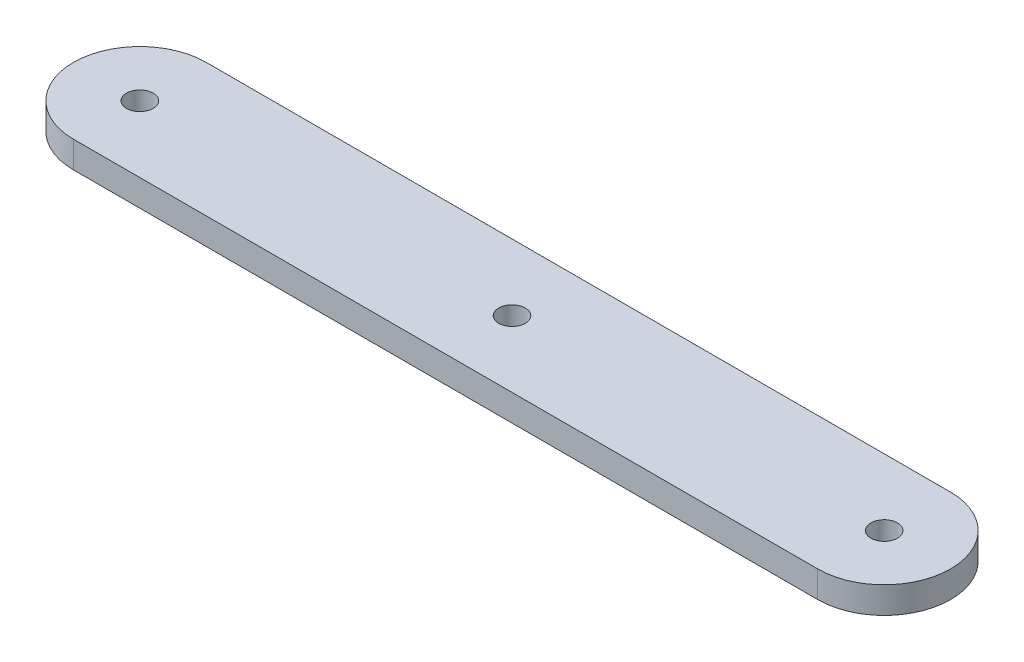
ISO-10303-21;
HEADER;
FILE_DESCRIPTION(('STEP AP214'),'2;1');
FILE_NAME('part.step','',(''),(''),'','','');
FILE_SCHEMA(('AUTOMOTIVE_DESIGN { 1 0 10303 214 1 1 1 1 }'));
ENDSEC;
DATA;
#1=APPLICATION_CONTEXT('core data for automotive mechanical design processes');
#2=APPLICATION_PROTOCOL_DEFINITION('international standard','automotive_design',2000,#1);
#3=PRODUCT_CONTEXT('',#1,'mechanical');
#4=PRODUCT('Part','Part','',(#3));
#5=PRODUCT_RELATED_PRODUCT_CATEGORY('part','',(#4));
#6=PRODUCT_DEFINITION_FORMATION('','',#4);
#7=PRODUCT_DEFINITION_CONTEXT('part definition',#1,'design');
#8=PRODUCT_DEFINITION('design','',#6,#7);
#9=PRODUCT_DEFINITION_SHAPE('','',#8);
#10=(LENGTH_UNIT() NAMED_UNIT(*) SI_UNIT(.MILLI.,.METRE.));
#11=(NAMED_UNIT(*) PLANE_ANGLE_UNIT() SI_UNIT($,.RADIAN.));
#12=(NAMED_UNIT(*) SI_UNIT($,.STERADIAN.) SOLID_ANGLE_UNIT());
#13=UNCERTAINTY_MEASURE_WITH_UNIT(LENGTH_MEASURE(1.E-05),#10,'distance_accuracy_value','');
#14=(GEOMETRIC_REPRESENTATION_CONTEXT(3) GLOBAL_UNCERTAINTY_ASSIGNED_CONTEXT((#13)) GLOBAL_UNIT_ASSIGNED_CONTEXT((#10,
#11,#12)) REPRESENTATION_CONTEXT('',''));
#15=CARTESIAN_POINT('',(0.,0.,0.));
#16=DIRECTION('',(0.,0.,1.));
#17=DIRECTION('',(1.,0.,0.));
#18=AXIS2_PLACEMENT_3D('',#15,#16,#17);
#19=CARTESIAN_POINT('',(-14.,0.5,0.));
#20=DIRECTION('',(0.,1.,0.));
#21=DIRECTION('',(0.,0.,1.));
#22=AXIS2_PLACEMENT_3D('',#19,#20,#21);
#23=PLANE('',#22);
#24=CARTESIAN_POINT('',(-14.,0.5,0.));
#25=DIRECTION('',(0.,1.,0.));
#26=DIRECTION('',(0.,0.,1.));
#27=AXIS2_PLACEMENT_3D('',#24,#25,#26);
#28=CIRCLE('',#27,0.500000000000001);
#29=CARTESIAN_POINT('',(-14.,0.5,0.500000000000001));
#30=VERTEX_POINT('',#29);
#31=EDGE_CURVE('E115',#30,#30,#28,.T.);
#32=ORIENTED_EDGE('',*,*,#31,.F.);
#33=EDGE_LOOP('',(#32));
#34=FACE_BOUND('',#33,.T.);
#35=CARTESIAN_POINT('',(-14.,0.5,0.));
#36=DIRECTION('',(0.,1.,0.));
#37=DIRECTION('',(0.,0.,1.));
#38=AXIS2_PLACEMENT_3D('',#35,#36,#37);
#39=CIRCLE('',#38,2.5);
#40=CARTESIAN_POINT('',(-14.,0.5,-2.5));
#41=VERTEX_POINT('',#40);
#42=CARTESIAN_POINT('',(-14.,0.5,2.5));
#43=VERTEX_POINT('',#42);
#44=EDGE_CURVE('E85',#41,#43,#39,.T.);
#45=ORIENTED_EDGE('',*,*,#44,.T.);
#46=DIRECTION('',(1.,0.,0.));
#47=VECTOR('',#46,1.);
#48=CARTESIAN_POINT('',(-14.,0.5,2.5));
#49=LINE('',#48,#47);
#50=CARTESIAN_POINT('',(14.,0.5,2.49999999999999));
#51=VERTEX_POINT('',#50);
#52=EDGE_CURVE('E80',#43,#51,#49,.T.);
#53=ORIENTED_EDGE('',*,*,#52,.T.);
#54=CARTESIAN_POINT('',(14.,0.5,0.));
#55=DIRECTION('',(0.,1.,0.));
#56=DIRECTION('',(0.,0.,1.));
#57=AXIS2_PLACEMENT_3D('',#54,#55,#56);
#58=CIRCLE('',#57,2.5);
#59=CARTESIAN_POINT('',(14.,0.5,-2.50000000000001));
#60=VERTEX_POINT('',#59);
#61=EDGE_CURVE('E83',#51,#60,#58,.T.);
#62=ORIENTED_EDGE('',*,*,#61,.T.);
#63=DIRECTION('',(-1.,0.,0.));
#64=VECTOR('',#63,1.);
#65=CARTESIAN_POINT('',(-14.,0.5,-2.5));
#66=LINE('',#65,#64);
#67=EDGE_CURVE('E50',#60,#41,#66,.T.);
#68=ORIENTED_EDGE('',*,*,#67,.T.);
#69=EDGE_LOOP('',(#45,#53,#62,#68));
#70=FACE_BOUND('',#69,.T.);
#71=CARTESIAN_POINT('',(0.,0.5,0.));
#72=DIRECTION('',(0.,1.,0.));
#73=DIRECTION('',(0.,0.,1.));
#74=AXIS2_PLACEMENT_3D('',#71,#72,#73);
#75=CIRCLE('',#74,0.5);
#76=CARTESIAN_POINT('',(0.,0.5,0.499999999999999));
#77=VERTEX_POINT('',#76);
#78=EDGE_CURVE('E100',#77,#77,#75,.T.);
#79=ORIENTED_EDGE('',*,*,#78,.F.);
#80=EDGE_LOOP('',(#79));
#81=FACE_BOUND('',#80,.T.);
#82=CARTESIAN_POINT('',(14.,0.5,0.));
#83=DIRECTION('',(0.,1.,0.));
#84=DIRECTION('',(0.,0.,1.));
#85=AXIS2_PLACEMENT_3D('',#82,#83,#84);
#86=CIRCLE('',#85,0.500000000000001);
#87=CARTESIAN_POINT('',(14.,0.5,0.499999999999996));
#88=VERTEX_POINT('',#87);
#89=EDGE_CURVE('E121',#88,#88,#86,.T.);
#90=ORIENTED_EDGE('',*,*,#89,.F.);
#91=EDGE_LOOP('',(#90));
#92=FACE_BOUND('',#91,.T.);
#93=ADVANCED_FACE('F33',(#34,#70,#81,#92),#23,.T.);
#94=CARTESIAN_POINT('',(-14.,-0.5,0.));
#95=DIRECTION('',(0.,1.,0.));
#96=DIRECTION('',(0.,0.,1.));
#97=AXIS2_PLACEMENT_3D('',#94,#95,#96);
#98=PLANE('',#97);
#99=CARTESIAN_POINT('',(-14.,-0.5,0.));
#100=DIRECTION('',(0.,1.,0.));
#101=DIRECTION('',(0.,0.,1.));
#102=AXIS2_PLACEMENT_3D('',#99,#100,#101);
#103=CIRCLE('',#102,2.5);
#104=CARTESIAN_POINT('',(-14.,-0.5,-2.5));
#105=VERTEX_POINT('',#104);
#106=CARTESIAN_POINT('',(-14.,-0.5,2.5));
#107=VERTEX_POINT('',#106);
#108=EDGE_CURVE('E97',#105,#107,#103,.T.);
#109=ORIENTED_EDGE('',*,*,#108,.F.);
#110=DIRECTION('',(-1.,0.,0.));
#111=VECTOR('',#110,1.);
#112=CARTESIAN_POINT('',(-14.,-0.5,-2.5));
#113=LINE('',#112,#111);
#114=CARTESIAN_POINT('',(14.,-0.5,-2.50000000000001));
#115=VERTEX_POINT('',#114);
#116=EDGE_CURVE('E73',#115,#105,#113,.T.);
#117=ORIENTED_EDGE('',*,*,#116,.F.);
#118=CARTESIAN_POINT('',(14.,-0.5,0.));
#119=DIRECTION('',(0.,1.,0.));
#120=DIRECTION('',(0.,0.,1.));
#121=AXIS2_PLACEMENT_3D('',#118,#119,#120);
#122=CIRCLE('',#121,2.5);
#123=CARTESIAN_POINT('',(14.,-0.5,2.49999999999999));
#124=VERTEX_POINT('',#123);
#125=EDGE_CURVE('E67',#124,#115,#122,.T.);
#126=ORIENTED_EDGE('',*,*,#125,.F.);
#127=DIRECTION('',(1.,0.,0.));
#128=VECTOR('',#127,1.);
#129=CARTESIAN_POINT('',(-14.,-0.5,2.5));
#130=LINE('',#129,#128);
#131=EDGE_CURVE('E89',#107,#124,#130,.T.);
#132=ORIENTED_EDGE('',*,*,#131,.F.);
#133=EDGE_LOOP('',(#109,#117,#126,#132));
#134=FACE_BOUND('',#133,.T.);
#135=CARTESIAN_POINT('',(0.,-0.5,0.));
#136=DIRECTION('',(0.,1.,0.));
#137=DIRECTION('',(0.,0.,1.));
#138=AXIS2_PLACEMENT_3D('',#135,#136,#137);
#139=CIRCLE('',#138,0.5);
#140=CARTESIAN_POINT('',(0.,-0.5,0.499999999999999));
#141=VERTEX_POINT('',#140);
#142=EDGE_CURVE('E112',#141,#141,#139,.T.);
#143=ORIENTED_EDGE('',*,*,#142,.T.);
#144=EDGE_LOOP('',(#143));
#145=FACE_BOUND('',#144,.T.);
#146=CARTESIAN_POINT('',(-14.,-0.5,0.));
#147=DIRECTION('',(0.,1.,0.));
#148=DIRECTION('',(0.,0.,1.));
#149=AXIS2_PLACEMENT_3D('',#146,#147,#148);
#150=CIRCLE('',#149,0.500000000000001);
#151=CARTESIAN_POINT('',(-14.,-0.5,0.500000000000001));
#152=VERTEX_POINT('',#151);
#153=EDGE_CURVE('E118',#152,#152,#150,.T.);
#154=ORIENTED_EDGE('',*,*,#153,.T.);
#155=EDGE_LOOP('',(#154));
#156=FACE_BOUND('',#155,.T.);
#157=CARTESIAN_POINT('',(14.,-0.5,0.));
#158=DIRECTION('',(0.,1.,0.));
#159=DIRECTION('',(0.,0.,1.));
#160=AXIS2_PLACEMENT_3D('',#157,#158,#159);
#161=CIRCLE('',#160,0.500000000000001);
#162=CARTESIAN_POINT('',(14.,-0.5,0.499999999999996));
#163=VERTEX_POINT('',#162);
#164=EDGE_CURVE('E124',#163,#163,#161,.T.);
#165=ORIENTED_EDGE('',*,*,#164,.T.);
#166=EDGE_LOOP('',(#165));
#167=FACE_BOUND('',#166,.T.);
#168=ADVANCED_FACE('F108',(#134,#145,#156,#167),#98,.F.);
#169=CARTESIAN_POINT('',(-14.,0.5,0.));
#170=DIRECTION('',(0.,-1.,0.));
#171=DIRECTION('',(0.,0.,-1.));
#172=AXIS2_PLACEMENT_3D('',#169,#170,#171);
#173=CYLINDRICAL_SURFACE('',#172,2.5);
#174=ORIENTED_EDGE('',*,*,#108,.T.);
#175=DIRECTION('',(0.,-1.,0.));
#176=VECTOR('',#175,1.);
#177=CARTESIAN_POINT('',(-14.,0.5,2.5));
#178=LINE('',#177,#176);
#179=EDGE_CURVE('E11',#43,#107,#178,.T.);
#180=ORIENTED_EDGE('',*,*,#179,.F.);
#181=ORIENTED_EDGE('',*,*,#44,.F.);
#182=DIRECTION('',(0.,-1.,0.));
#183=VECTOR('',#182,1.);
#184=CARTESIAN_POINT('',(-14.,0.5,-2.5));
#185=LINE('',#184,#183);
#186=EDGE_CURVE('E93',#41,#105,#185,.T.);
#187=ORIENTED_EDGE('',*,*,#186,.T.);
#188=EDGE_LOOP('',(#174,#180,#181,#187));
#189=FACE_BOUND('',#188,.T.);
#190=ADVANCED_FACE('F35',(#189),#173,.T.);
#191=CARTESIAN_POINT('',(-14.,0.5,2.5));
#192=DIRECTION('',(0.,0.,-1.));
#193=DIRECTION('',(-1.,0.,0.));
#194=AXIS2_PLACEMENT_3D('',#191,#192,#193);
#195=PLANE('',#194);
#196=ORIENTED_EDGE('',*,*,#131,.T.);
#197=DIRECTION('',(0.,-1.,0.));
#198=VECTOR('',#197,1.);
#199=CARTESIAN_POINT('',(14.,0.5,2.49999999999999));
#200=LINE('',#199,#198);
#201=EDGE_CURVE('E42',#51,#124,#200,.T.);
#202=ORIENTED_EDGE('',*,*,#201,.F.);
#203=ORIENTED_EDGE('',*,*,#52,.F.);
#204=ORIENTED_EDGE('',*,*,#179,.T.);
#205=EDGE_LOOP('',(#196,#202,#203,#204));
#206=FACE_BOUND('',#205,.T.);
#207=ADVANCED_FACE('F88',(#206),#195,.F.);
#208=CARTESIAN_POINT('',(14.,0.5,0.));
#209=DIRECTION('',(0.,-1.,0.));
#210=DIRECTION('',(0.,0.,-1.));
#211=AXIS2_PLACEMENT_3D('',#208,#209,#210);
#212=CYLINDRICAL_SURFACE('',#211,2.5);
#213=ORIENTED_EDGE('',*,*,#125,.T.);
#214=DIRECTION('',(0.,-1.,0.));
#215=VECTOR('',#214,1.);
#216=CARTESIAN_POINT('',(14.,0.5,-2.50000000000001));
#217=LINE('',#216,#215);
#218=EDGE_CURVE('E90',#60,#115,#217,.T.);
#219=ORIENTED_EDGE('',*,*,#218,.F.);
#220=ORIENTED_EDGE('',*,*,#61,.F.);
#221=ORIENTED_EDGE('',*,*,#201,.T.);
#222=EDGE_LOOP('',(#213,#219,#220,#221));
#223=FACE_BOUND('',#222,.T.);
#224=ADVANCED_FACE('F91',(#223),#212,.T.);
#225=CARTESIAN_POINT('',(-14.,0.5,-2.5));
#226=DIRECTION('',(0.,0.,1.));
#227=DIRECTION('',(1.,0.,0.));
#228=AXIS2_PLACEMENT_3D('',#225,#226,#227);
#229=PLANE('',#228);
#230=ORIENTED_EDGE('',*,*,#116,.T.);
#231=ORIENTED_EDGE('',*,*,#186,.F.);
#232=ORIENTED_EDGE('',*,*,#67,.F.);
#233=ORIENTED_EDGE('',*,*,#218,.T.);
#234=EDGE_LOOP('',(#230,#231,#232,#233));
#235=FACE_BOUND('',#234,.T.);
#236=ADVANCED_FACE('F105',(#235),#229,.F.);
#237=CARTESIAN_POINT('',(0.,0.5,0.));
#238=DIRECTION('',(0.,-1.,0.));
#239=DIRECTION('',(0.,0.,-1.));
#240=AXIS2_PLACEMENT_3D('',#237,#238,#239);
#241=CYLINDRICAL_SURFACE('',#240,0.5);
#242=ORIENTED_EDGE('',*,*,#78,.T.);
#243=EDGE_LOOP('',(#242));
#244=FACE_BOUND('',#243,.T.);
#245=ORIENTED_EDGE('',*,*,#142,.F.);
#246=EDGE_LOOP('',(#245));
#247=FACE_BOUND('',#246,.T.);
#248=ADVANCED_FACE('F142',(#244,#247),#241,.F.);
#249=CARTESIAN_POINT('',(-14.,0.5,0.));
#250=DIRECTION('',(0.,-1.,0.));
#251=DIRECTION('',(0.,0.,-1.));
#252=AXIS2_PLACEMENT_3D('',#249,#250,#251);
#253=CYLINDRICAL_SURFACE('',#252,0.500000000000001);
#254=ORIENTED_EDGE('',*,*,#31,.T.);
#255=EDGE_LOOP('',(#254));
#256=FACE_BOUND('',#255,.T.);
#257=ORIENTED_EDGE('',*,*,#153,.F.);
#258=EDGE_LOOP('',(#257));
#259=FACE_BOUND('',#258,.T.);
#260=ADVANCED_FACE('F188',(#256,#259),#253,.F.);
#261=CARTESIAN_POINT('',(14.,0.5,0.));
#262=DIRECTION('',(0.,-1.,0.));
#263=DIRECTION('',(0.,0.,-1.));
#264=AXIS2_PLACEMENT_3D('',#261,#262,#263);
#265=CYLINDRICAL_SURFACE('',#264,0.500000000000001);
#266=ORIENTED_EDGE('',*,*,#89,.T.);
#267=EDGE_LOOP('',(#266));
#268=FACE_BOUND('',#267,.T.);
#269=ORIENTED_EDGE('',*,*,#164,.F.);
#270=EDGE_LOOP('',(#269));
#271=FACE_BOUND('',#270,.T.);
#272=ADVANCED_FACE('F130',(#268,#271),#265,.F.);
#273=CLOSED_SHELL('',(#93,#168,#190,#207,#224,#236,#248,#260,#272));
#274=MANIFOLD_SOLID_BREP('B2',#273);
#275=ADVANCED_BREP_SHAPE_REPRESENTATION('',(#18,#274),#14);
#276=SHAPE_DEFINITION_REPRESENTATION(#9,#275);
ENDSEC;
END-ISO-10303-21;
